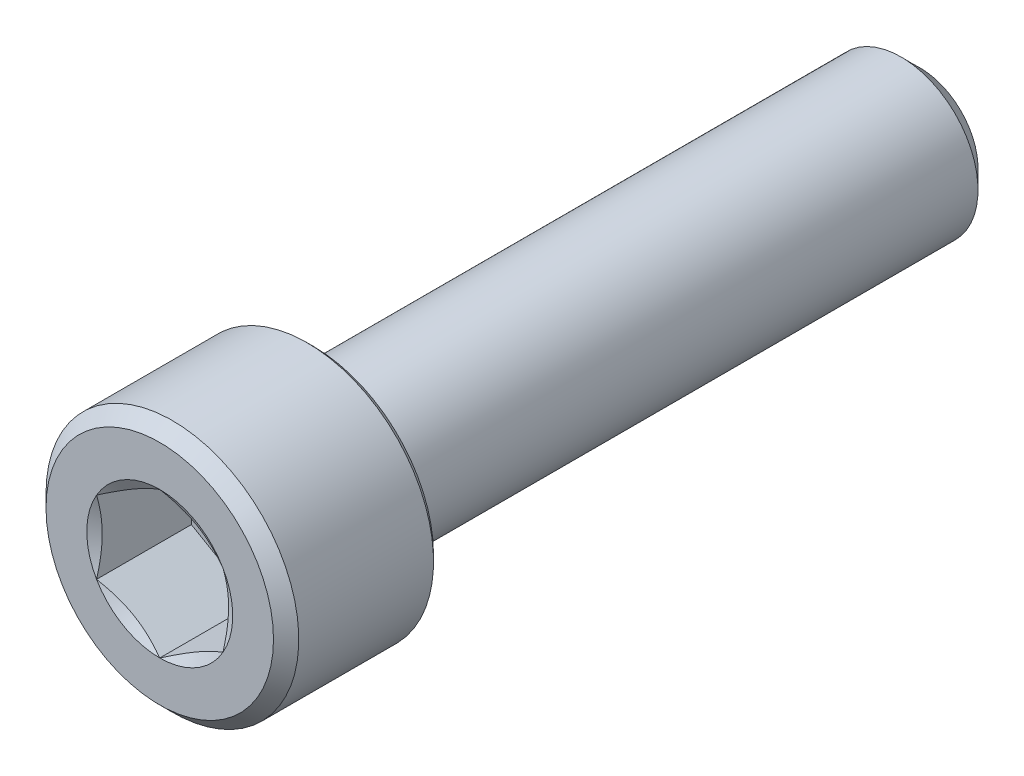
ISO-10303-21;
HEADER;
FILE_DESCRIPTION(('STEP AP214'),'2;1');
FILE_NAME('part.step','',(''),(''),'','','');
FILE_SCHEMA(('AUTOMOTIVE_DESIGN { 1 0 10303 214 1 1 1 1 }'));
ENDSEC;
DATA;
#1=APPLICATION_CONTEXT('core data for automotive mechanical design processes');
#2=APPLICATION_PROTOCOL_DEFINITION('international standard','automotive_design',2000,#1);
#3=PRODUCT_CONTEXT('',#1,'mechanical');
#4=PRODUCT('Part','Part','',(#3));
#5=PRODUCT_RELATED_PRODUCT_CATEGORY('part','',(#4));
#6=PRODUCT_DEFINITION_FORMATION('','',#4);
#7=PRODUCT_DEFINITION_CONTEXT('part definition',#1,'design');
#8=PRODUCT_DEFINITION('design','',#6,#7);
#9=PRODUCT_DEFINITION_SHAPE('','',#8);
#10=(LENGTH_UNIT() NAMED_UNIT(*) SI_UNIT(.MILLI.,.METRE.));
#11=(NAMED_UNIT(*) PLANE_ANGLE_UNIT() SI_UNIT($,.RADIAN.));
#12=(NAMED_UNIT(*) SI_UNIT($,.STERADIAN.) SOLID_ANGLE_UNIT());
#13=UNCERTAINTY_MEASURE_WITH_UNIT(LENGTH_MEASURE(1.E-05),#10,'distance_accuracy_value','');
#14=(GEOMETRIC_REPRESENTATION_CONTEXT(3) GLOBAL_UNCERTAINTY_ASSIGNED_CONTEXT((#13)) GLOBAL_UNIT_ASSIGNED_CONTEXT((#10,
#11,#12)) REPRESENTATION_CONTEXT('',''));
#15=CARTESIAN_POINT('',(0.,0.,0.));
#16=DIRECTION('',(0.,0.,1.));
#17=DIRECTION('',(1.,0.,0.));
#18=AXIS2_PLACEMENT_3D('',#15,#16,#17);
#19=CARTESIAN_POINT('',(0.,3.96875,11.938));
#20=DIRECTION('',(0.,0.,1.));
#21=DIRECTION('',(1.,0.,0.));
#22=AXIS2_PLACEMENT_3D('',#19,#20,#21);
#23=PLANE('',#22);
#24=CARTESIAN_POINT('',(0.,0.,11.938));
#25=DIRECTION('',(0.,0.,1.));
#26=DIRECTION('',(1.,0.,0.));
#27=AXIS2_PLACEMENT_3D('',#24,#25,#26);
#28=CIRCLE('',#27,3.571875);
#29=CARTESIAN_POINT('',(-3.571875,0.,11.938));
#30=VERTEX_POINT('',#29);
#31=EDGE_CURVE('E169',#30,#30,#28,.T.);
#32=ORIENTED_EDGE('',*,*,#31,.T.);
#33=EDGE_LOOP('',(#32));
#34=FACE_BOUND('',#33,.T.);
#35=CARTESIAN_POINT('',(0.,0.,11.938));
#36=DIRECTION('',(0.,0.,1.));
#37=DIRECTION('',(1.,0.,0.));
#38=AXIS2_PLACEMENT_3D('',#35,#36,#37);
#39=CIRCLE('',#38,2.29135888084633);
#40=CARTESIAN_POINT('',(1.984375,1.14567944042316,11.938));
#41=VERTEX_POINT('',#40);
#42=CARTESIAN_POINT('',(0.,2.29135888084632,11.938));
#43=VERTEX_POINT('',#42);
#44=EDGE_CURVE('E87',#41,#43,#39,.T.);
#45=ORIENTED_EDGE('',*,*,#44,.F.);
#46=CARTESIAN_POINT('',(1.984375,-1.14567944042316,11.938));
#47=VERTEX_POINT('',#46);
#48=EDGE_CURVE('E47',#47,#41,#39,.T.);
#49=ORIENTED_EDGE('',*,*,#48,.F.);
#50=CARTESIAN_POINT('',(0.,-2.29135888084633,11.938));
#51=VERTEX_POINT('',#50);
#52=EDGE_CURVE('E274',#51,#47,#39,.T.);
#53=ORIENTED_EDGE('',*,*,#52,.F.);
#54=CARTESIAN_POINT('',(-1.984375,-1.14567944042317,11.938));
#55=VERTEX_POINT('',#54);
#56=EDGE_CURVE('E54',#55,#51,#39,.T.);
#57=ORIENTED_EDGE('',*,*,#56,.F.);
#58=CARTESIAN_POINT('',(-1.984375,1.14567944042316,11.938));
#59=VERTEX_POINT('',#58);
#60=EDGE_CURVE('E127',#59,#55,#39,.T.);
#61=ORIENTED_EDGE('',*,*,#60,.F.);
#62=EDGE_CURVE('E96',#43,#59,#39,.T.);
#63=ORIENTED_EDGE('',*,*,#62,.F.);
#64=EDGE_LOOP('',(#45,#49,#53,#57,#61,#63));
#65=FACE_BOUND('',#64,.T.);
#66=ADVANCED_FACE('F33',(#34,#65),#23,.T.);
#67=CARTESIAN_POINT('',(0.,0.,-11.938));
#68=DIRECTION('',(0.,0.,-1.));
#69=DIRECTION('',(-1.,0.,0.));
#70=AXIS2_PLACEMENT_3D('',#67,#68,#69);
#71=CYLINDRICAL_SURFACE('',#70,3.96875);
#72=CARTESIAN_POINT('',(0.,0.,7.3104375));
#73=DIRECTION('',(0.,0.,-1.));
#74=DIRECTION('',(-1.,0.,0.));
#75=AXIS2_PLACEMENT_3D('',#72,#73,#74);
#76=CIRCLE('',#75,3.96875);
#77=CARTESIAN_POINT('',(-3.96875,0.,7.3104375));
#78=VERTEX_POINT('',#77);
#79=EDGE_CURVE('E11',#78,#78,#76,.F.);
#80=ORIENTED_EDGE('',*,*,#79,.T.);
#81=EDGE_LOOP('',(#80));
#82=FACE_BOUND('',#81,.T.);
#83=CARTESIAN_POINT('',(0.,0.,11.541125));
#84=DIRECTION('',(0.,0.,1.));
#85=DIRECTION('',(1.,0.,0.));
#86=AXIS2_PLACEMENT_3D('',#83,#84,#85);
#87=CIRCLE('',#86,3.96875);
#88=CARTESIAN_POINT('',(-3.96875,0.,11.541125));
#89=VERTEX_POINT('',#88);
#90=EDGE_CURVE('E106',#89,#89,#87,.F.);
#91=ORIENTED_EDGE('',*,*,#90,.T.);
#92=EDGE_LOOP('',(#91));
#93=FACE_BOUND('',#92,.T.);
#94=ADVANCED_FACE('F186',(#82,#93),#71,.T.);
#95=CARTESIAN_POINT('',(0.,3.96875,7.112));
#96=DIRECTION('',(0.,0.,-1.));
#97=DIRECTION('',(-1.,0.,0.));
#98=AXIS2_PLACEMENT_3D('',#95,#96,#97);
#99=PLANE('',#98);
#100=CARTESIAN_POINT('',(0.,0.,7.112));
#101=DIRECTION('',(0.,0.,-1.));
#102=DIRECTION('',(-1.,0.,0.));
#103=AXIS2_PLACEMENT_3D('',#100,#101,#102);
#104=CIRCLE('',#103,3.7703125);
#105=CARTESIAN_POINT('',(-3.7703125,0.,7.112));
#106=VERTEX_POINT('',#105);
#107=EDGE_CURVE('E41',#106,#106,#104,.T.);
#108=ORIENTED_EDGE('',*,*,#107,.T.);
#109=EDGE_LOOP('',(#108));
#110=FACE_BOUND('',#109,.T.);
#111=CARTESIAN_POINT('',(0.,0.,7.112));
#112=DIRECTION('',(0.,0.,-1.));
#113=DIRECTION('',(-1.,0.,0.));
#114=AXIS2_PLACEMENT_3D('',#111,#112,#113);
#115=CIRCLE('',#114,2.413);
#116=CARTESIAN_POINT('',(-2.413,0.,7.112));
#117=VERTEX_POINT('',#116);
#118=EDGE_CURVE('E107',#117,#117,#115,.T.);
#119=ORIENTED_EDGE('',*,*,#118,.F.);
#120=EDGE_LOOP('',(#119));
#121=FACE_BOUND('',#120,.T.);
#122=ADVANCED_FACE('F174',(#110,#121),#99,.T.);
#123=CARTESIAN_POINT('',(0.,0.,-11.938));
#124=DIRECTION('',(0.,0.,-1.));
#125=DIRECTION('',(-1.,0.,0.));
#126=AXIS2_PLACEMENT_3D('',#123,#124,#125);
#127=CYLINDRICAL_SURFACE('',#126,2.413);
#128=ORIENTED_EDGE('',*,*,#118,.T.);
#129=EDGE_LOOP('',(#128));
#130=FACE_BOUND('',#129,.T.);
#131=CARTESIAN_POINT('',(0.,0.,-11.3426875));
#132=DIRECTION('',(0.,0.,-1.));
#133=DIRECTION('',(-1.,0.,0.));
#134=AXIS2_PLACEMENT_3D('',#131,#132,#133);
#135=CIRCLE('',#134,2.413);
#136=CARTESIAN_POINT('',(-2.413,0.,-11.3426875));
#137=VERTEX_POINT('',#136);
#138=EDGE_CURVE('E215',#137,#137,#135,.T.);
#139=ORIENTED_EDGE('',*,*,#138,.F.);
#140=EDGE_LOOP('',(#139));
#141=FACE_BOUND('',#140,.T.);
#142=ADVANCED_FACE('F197',(#130,#141),#127,.T.);
#143=CARTESIAN_POINT('',(0.,0.,-11.938));
#144=DIRECTION('',(0.,0.,1.));
#145=DIRECTION('',(1.,0.,0.));
#146=AXIS2_PLACEMENT_3D('',#143,#144,#145);
#147=CONICAL_SURFACE('',#146,1.8176875,0.785398163397443);
#148=ORIENTED_EDGE('',*,*,#138,.T.);
#149=EDGE_LOOP('',(#148));
#150=FACE_BOUND('',#149,.T.);
#151=CARTESIAN_POINT('',(0.,0.,-11.938));
#152=DIRECTION('',(0.,0.,-1.));
#153=DIRECTION('',(-1.,0.,0.));
#154=AXIS2_PLACEMENT_3D('',#151,#152,#153);
#155=CIRCLE('',#154,1.8176875);
#156=CARTESIAN_POINT('',(-1.8176875,0.,-11.938));
#157=VERTEX_POINT('',#156);
#158=EDGE_CURVE('E213',#157,#157,#155,.T.);
#159=ORIENTED_EDGE('',*,*,#158,.F.);
#160=EDGE_LOOP('',(#159));
#161=FACE_BOUND('',#160,.T.);
#162=ADVANCED_FACE('F200',(#150,#161),#147,.T.);
#163=CARTESIAN_POINT('',(0.,1.8176875,-11.938));
#164=DIRECTION('',(0.,0.,-1.));
#165=DIRECTION('',(-1.,0.,0.));
#166=AXIS2_PLACEMENT_3D('',#163,#164,#165);
#167=PLANE('',#166);
#168=ORIENTED_EDGE('',*,*,#158,.T.);
#169=EDGE_LOOP('',(#168));
#170=FACE_BOUND('',#169,.T.);
#171=ADVANCED_FACE('F203',(#170),#167,.T.);
#172=CARTESIAN_POINT('',(0.,0.,11.938));
#173=DIRECTION('',(0.,0.,1.));
#174=DIRECTION('',(1.,0.,0.));
#175=AXIS2_PLACEMENT_3D('',#172,#173,#174);
#176=CONICAL_SURFACE('',#175,2.29135888084633,1.0471975511966);
#177=ORIENTED_EDGE('',*,*,#62,.T.);
#178=CARTESIAN_POINT('',(0.000199999999999337,2.29147435090016,11.9380666717058));
#179=CARTESIAN_POINT('',(-0.0870046387806771,2.24112672922556,11.9089856822402));
#180=CARTESIAN_POINT('',(-0.174962019304997,2.19034451190263,11.8825372080271));
#181=CARTESIAN_POINT('',(-0.352399978672321,2.08790065829744,11.8363702712065));
#182=CARTESIAN_POINT('',(-0.44188371125632,2.03623720120198,11.816668142249));
#183=CARTESIAN_POINT('',(-0.61974214801247,1.93355058486317,11.7859977319315));
#184=CARTESIAN_POINT('',(-0.708089480306095,1.88254322878126,11.7748253427202));
#185=CARTESIAN_POINT('',(-0.885200028110951,1.78028840632981,11.7614857960544));
#186=CARTESIAN_POINT('',(-0.973962599510548,1.72904131183828,11.7593075944601));
#187=CARTESIAN_POINT('',(-1.13983230286466,1.63327639395638,11.7638295515083));
#188=CARTESIAN_POINT('',(-1.21696421566591,1.58874426333747,11.7694194134559));
#189=CARTESIAN_POINT('',(-1.37072550718908,1.49997014028562,11.787138933897));
#190=CARTESIAN_POINT('',(-1.44735435374553,1.45572845509857,11.7992746503295));
#191=CARTESIAN_POINT('',(-1.60143288850678,1.36677117157781,11.8296141588444));
#192=CARTESIAN_POINT('',(-1.67886306721268,1.32206683705856,11.847946609291));
#193=CARTESIAN_POINT('',(-1.83256831124359,1.23332507304146,11.8895545064002));
#194=CARTESIAN_POINT('',(-1.90884534705293,1.18928650588395,11.9128201712824));
#195=CARTESIAN_POINT('',(-1.984575,1.14556397036932,11.9380666717058));
#196=B_SPLINE_CURVE_WITH_KNOTS('',3,(#178,#179,#180,#181,#182,#183,#184,#185,#186,#187,#188,
#189,#190,#191,#192,#193,#194,#195),.UNSPECIFIED.,.F.,.F.,(4,2,2,2,2,2,2,2,4),(0.,
0.314555137114086,0.629866549668807,0.937373439505935,1.24450262309398,1.51196650590478,
1.77967834211415,2.05332989762155,2.32644383656793),.UNSPECIFIED.);
#197=EDGE_CURVE('E101',#43,#59,#196,.T.);
#198=ORIENTED_EDGE('',*,*,#197,.F.);
#199=EDGE_LOOP('',(#177,#198));
#200=FACE_BOUND('',#199,.T.);
#201=ADVANCED_FACE('F102',(#200),#176,.F.);
#202=ORIENTED_EDGE('',*,*,#60,.T.);
#203=CARTESIAN_POINT('',(-1.984375,-2.96692860034506,12.6758606510924));
#204=CARTESIAN_POINT('',(-1.984375,-2.88123645369666,12.6347488017753));
#205=CARTESIAN_POINT('',(-1.984375,-2.79533554929687,12.5940639729561));
#206=CARTESIAN_POINT('',(-1.984375,-2.62300496253372,12.5137905979452));
#207=CARTESIAN_POINT('',(-1.984375,-2.53657518838115,12.4742022490471));
#208=CARTESIAN_POINT('',(-1.984375,-2.36258003650985,12.3961429144296));
#209=CARTESIAN_POINT('',(-1.984375,-2.27501095051754,12.3576801633989));
#210=CARTESIAN_POINT('',(-1.984375,-2.09913795632987,12.2824794270975));
#211=CARTESIAN_POINT('',(-1.984375,-2.01083408662377,12.2457413521464));
#212=CARTESIAN_POINT('',(-1.984375,-1.83102497893539,12.173513729355));
#213=CARTESIAN_POINT('',(-1.984375,-1.73949640320228,12.1380819390739));
#214=CARTESIAN_POINT('',(-1.984375,-1.55533214713673,12.0701641835568));
#215=CARTESIAN_POINT('',(-1.984375,-1.46269633980312,12.0376785599926));
#216=CARTESIAN_POINT('',(-1.984375,-1.27638419434466,11.9765821363592));
#217=CARTESIAN_POINT('',(-1.984375,-1.18271082678456,11.9479623752382));
#218=CARTESIAN_POINT('',(-1.984375,-0.994021652382587,11.8955763688606));
#219=CARTESIAN_POINT('',(-1.984375,-0.899006185229732,11.8718089181985));
#220=CARTESIAN_POINT('',(-1.984375,-0.707830512458421,11.8303947393806));
#221=CARTESIAN_POINT('',(-1.984375,-0.61167308437324,11.812735440066));
#222=CARTESIAN_POINT('',(-1.984375,-0.418283092113672,11.7846930965335));
#223=CARTESIAN_POINT('',(-1.984375,-0.321050601045251,11.7743095606059));
#224=CARTESIAN_POINT('',(-1.984375,-0.127210752774484,11.7617852009906));
#225=CARTESIAN_POINT('',(-1.984375,-0.0306098639781242,11.7595471073686));
#226=CARTESIAN_POINT('',(-1.984375,0.162431915887105,11.7632420470322));
#227=CARTESIAN_POINT('',(-1.984375,0.258872796678697,11.7691755862751));
#228=CARTESIAN_POINT('',(-1.984375,0.496826477184733,11.7933755736915));
#229=CARTESIAN_POINT('',(-1.984375,0.637878211825127,11.8161772202142));
#230=CARTESIAN_POINT('',(-1.984375,0.917238703702528,11.8749760242614));
#231=CARTESIAN_POINT('',(-1.984375,1.05554394232965,11.9109890855425));
#232=CARTESIAN_POINT('',(-1.984375,1.26239464896717,11.9725082078903));
#233=CARTESIAN_POINT('',(-1.984375,1.33200934564274,11.9945514264146));
#234=CARTESIAN_POINT('',(-1.984375,1.47051409380588,12.0406769862575));
#235=CARTESIAN_POINT('',(-1.984375,1.53940456776433,12.0647580550061));
#236=CARTESIAN_POINT('',(-1.984375,1.67655293465251,12.1146095886895));
#237=CARTESIAN_POINT('',(-1.984375,1.74481093998431,12.1403797466023));
#238=CARTESIAN_POINT('',(-1.984375,1.88078910071683,12.1933307126816));
#239=CARTESIAN_POINT('',(-1.984375,1.94850916300286,12.220511759183));
#240=CARTESIAN_POINT('',(-1.984375,2.12136731788458,12.2916336238359));
#241=CARTESIAN_POINT('',(-1.984375,2.22615977384556,12.3364135967013));
#242=CARTESIAN_POINT('',(-1.984375,2.43479837304526,12.4281321956825));
#243=CARTESIAN_POINT('',(-1.984375,2.5386444446916,12.4750709835113));
#244=CARTESIAN_POINT('',(-1.984375,2.84907841644385,12.6183645613235));
#245=CARTESIAN_POINT('',(-1.984375,3.05452739791262,12.7171818752644));
#246=CARTESIAN_POINT('',(-1.984375,3.46367014223902,12.9189608857248));
#247=CARTESIAN_POINT('',(-1.984375,3.66736143684958,13.021927527753));
#248=CARTESIAN_POINT('',(-1.984375,4.0733484486621,13.2305084165548));
#249=CARTESIAN_POINT('',(-1.984375,4.27564433912762,13.3361223267935));
#250=CARTESIAN_POINT('',(-1.984375,4.66022184962415,13.5391193368616));
#251=CARTESIAN_POINT('',(-1.984375,4.84259034249047,13.6363384272925));
#252=CARTESIAN_POINT('',(-1.984375,5.20674070245669,13.8318843204883));
#253=CARTESIAN_POINT('',(-1.984375,5.38852254752481,13.9302111642466));
#254=CARTESIAN_POINT('',(-1.984375,5.7511724793118,14.127443617507));
#255=CARTESIAN_POINT('',(-1.984375,5.93204171415673,14.2263471187779));
#256=CARTESIAN_POINT('',(-1.984375,6.29341450955435,14.4247978398903));
#257=CARTESIAN_POINT('',(-1.984375,6.47391808874828,14.5243450257738));
#258=CARTESIAN_POINT('',(-1.984375,6.6542902961452,14.6241282522634));
#259=B_SPLINE_CURVE_WITH_KNOTS('',3,(#203,#204,#205,#206,#207,#208,#209,#210,#211,#212,#213,
#214,#215,#216,#217,#218,#219,#220,#221,#222,#223,#224,#225,#226,#227,#228,#229,#230,#231,#232,
#233,#234,#235,#236,#237,#238,#239,#240,#241,#242,#243,#244,#245,#246,#247,#248,#249,#250,#251,
#252,#253,#254,#255,#256,#257,#258),.UNSPECIFIED.,.F.,.F.,(4,2,2,2,2,2,2,2,2,2,2,2,2,2,2,2,2,2,
2,2,2,2,2,2,2,2,2,4),(0.,0.285135519832372,0.570322016122786,0.85723846381979,1.14413997577448,
1.43854271801315,1.7329795590899,2.02672173491208,2.32039085060263,2.61345191984503,
2.90649318156652,3.19602335108127,3.48557144803805,3.91334047285798,4.34162614021154,
4.56066589824458,4.7795698685272,4.99843415889189,5.21733554208811,5.55917796423186,
5.9010460350302,6.58489509249956,7.26958483186156,7.95418796687477,8.57417425374277,
9.19418355960939,9.81261585701216,10.431015790458),.UNSPECIFIED.);
#260=EDGE_CURVE('E95',#59,#55,#259,.F.);
#261=ORIENTED_EDGE('',*,*,#260,.F.);
#262=EDGE_LOOP('',(#202,#261));
#263=FACE_BOUND('',#262,.T.);
#264=ADVANCED_FACE('F210',(#263),#176,.F.);
#265=ORIENTED_EDGE('',*,*,#56,.T.);
#266=CARTESIAN_POINT('',(-1.984575,-1.14556397036933,11.9380666717058));
#267=CARTESIAN_POINT('',(-1.89737036121932,-1.19591159204393,11.9089856822402));
#268=CARTESIAN_POINT('',(-1.809412980695,-1.24669380936686,11.8825372080271));
#269=CARTESIAN_POINT('',(-1.63197502132768,-1.34913766297205,11.8363702712065));
#270=CARTESIAN_POINT('',(-1.54249128874368,-1.40080112006751,11.816668142249));
#271=CARTESIAN_POINT('',(-1.36463285198753,-1.50348773640632,11.7859977319315));
#272=CARTESIAN_POINT('',(-1.27628551969391,-1.55449509248823,11.7748253427202));
#273=CARTESIAN_POINT('',(-1.09917497188905,-1.65674991493968,11.7614857960544));
#274=CARTESIAN_POINT('',(-1.01041240048945,-1.7079970094312,11.7593075944601));
#275=CARTESIAN_POINT('',(-0.844542697135339,-1.80376192731311,11.7638295515083));
#276=CARTESIAN_POINT('',(-0.767410784334094,-1.84829405793202,11.7694194134559));
#277=CARTESIAN_POINT('',(-0.61364949281092,-1.93706818098387,11.787138933897));
#278=CARTESIAN_POINT('',(-0.537020646254476,-1.98130986617092,11.7992746503295));
#279=CARTESIAN_POINT('',(-0.382942111493217,-2.07026714969167,11.8296141588444));
#280=CARTESIAN_POINT('',(-0.305511932787317,-2.11497148421093,11.847946609291));
#281=CARTESIAN_POINT('',(-0.151806688756411,-2.20371324822803,11.8895545064002));
#282=CARTESIAN_POINT('',(-0.0755296529470673,-2.24775181538554,11.9128201712824));
#283=CARTESIAN_POINT('',(0.000200000000000565,-2.29147435090016,11.9380666717058));
#284=B_SPLINE_CURVE_WITH_KNOTS('',3,(#266,#267,#268,#269,#270,#271,#272,#273,#274,#275,#276,
#277,#278,#279,#280,#281,#282,#283),.UNSPECIFIED.,.F.,.F.,(4,2,2,2,2,2,2,2,4),(0.,
0.314555137114085,0.629866549668806,0.937373439505932,1.24450262309398,1.51196650590478,
1.77967834211415,2.05332989762155,2.32644383656793),.UNSPECIFIED.);
#285=EDGE_CURVE('E137',#55,#51,#284,.T.);
#286=ORIENTED_EDGE('',*,*,#285,.F.);
#287=EDGE_LOOP('',(#265,#286));
#288=FACE_BOUND('',#287,.T.);
#289=ADVANCED_FACE('F277',(#288),#176,.F.);
#290=ORIENTED_EDGE('',*,*,#52,.T.);
#291=CARTESIAN_POINT('',(-0.000199999999999211,-2.29147435090017,11.9380666717058));
#292=CARTESIAN_POINT('',(0.087004638780677,-2.24112672922556,11.9089856822402));
#293=CARTESIAN_POINT('',(0.174962019304997,-2.19034451190263,11.8825372080271));
#294=CARTESIAN_POINT('',(0.35239997867232,-2.08790065829744,11.8363702712065));
#295=CARTESIAN_POINT('',(0.441883711256319,-2.03623720120198,11.816668142249));
#296=CARTESIAN_POINT('',(0.619742148012468,-1.93355058486317,11.7859977319315));
#297=CARTESIAN_POINT('',(0.708089480306093,-1.88254322878126,11.7748253427202));
#298=CARTESIAN_POINT('',(0.885200028110949,-1.78028840632981,11.7614857960544));
#299=CARTESIAN_POINT('',(0.973962599510545,-1.72904131183829,11.7593075944601));
#300=CARTESIAN_POINT('',(1.13983230286466,-1.63327639395638,11.7638295515083));
#301=CARTESIAN_POINT('',(1.21696421566591,-1.58874426333747,11.7694194134559));
#302=CARTESIAN_POINT('',(1.37072550718908,-1.49997014028563,11.787138933897));
#303=CARTESIAN_POINT('',(1.44735435374552,-1.45572845509857,11.7992746503295));
#304=CARTESIAN_POINT('',(1.60143288850678,-1.36677117157782,11.8296141588444));
#305=CARTESIAN_POINT('',(1.67886306721268,-1.32206683705856,11.847946609291));
#306=CARTESIAN_POINT('',(1.83256831124359,-1.23332507304146,11.8895545064002));
#307=CARTESIAN_POINT('',(1.90884534705293,-1.18928650588395,11.9128201712824));
#308=CARTESIAN_POINT('',(1.984575,-1.14556397036933,11.9380666717058));
#309=B_SPLINE_CURVE_WITH_KNOTS('',3,(#291,#292,#293,#294,#295,#296,#297,#298,#299,#300,#301,
#302,#303,#304,#305,#306,#307,#308),.UNSPECIFIED.,.F.,.F.,(4,2,2,2,2,2,2,2,4),(0.,
0.314555137114085,0.629866549668805,0.937373439505931,1.24450262309398,1.51196650590478,
1.77967834211415,2.05332989762155,2.32644383656793),.UNSPECIFIED.);
#310=EDGE_CURVE('E251',#51,#47,#309,.T.);
#311=ORIENTED_EDGE('',*,*,#310,.F.);
#312=EDGE_LOOP('',(#290,#311));
#313=FACE_BOUND('',#312,.T.);
#314=ADVANCED_FACE('F276',(#313),#176,.F.);
#315=ORIENTED_EDGE('',*,*,#48,.T.);
#316=CARTESIAN_POINT('',(1.984375,-2.96692860034506,12.6758606510924));
#317=CARTESIAN_POINT('',(1.984375,-2.88123645369666,12.6347488017753));
#318=CARTESIAN_POINT('',(1.984375,-2.79533554929687,12.5940639729561));
#319=CARTESIAN_POINT('',(1.984375,-2.62300496253372,12.5137905979452));
#320=CARTESIAN_POINT('',(1.984375,-2.53657518838114,12.4742022490471));
#321=CARTESIAN_POINT('',(1.984375,-2.36258003650985,12.3961429144296));
#322=CARTESIAN_POINT('',(1.984375,-2.27501095051754,12.3576801633989));
#323=CARTESIAN_POINT('',(1.984375,-2.09913795632987,12.2824794270975));
#324=CARTESIAN_POINT('',(1.984375,-2.01083408662377,12.2457413521464));
#325=CARTESIAN_POINT('',(1.984375,-1.83102497893539,12.173513729355));
#326=CARTESIAN_POINT('',(1.984375,-1.73949640320228,12.1380819390739));
#327=CARTESIAN_POINT('',(1.984375,-1.55533214713673,12.0701641835568));
#328=CARTESIAN_POINT('',(1.984375,-1.46269633980312,12.0376785599926));
#329=CARTESIAN_POINT('',(1.984375,-1.27638419434466,11.9765821363592));
#330=CARTESIAN_POINT('',(1.984375,-1.18271082678456,11.9479623752382));
#331=CARTESIAN_POINT('',(1.984375,-0.994021652382587,11.8955763688606));
#332=CARTESIAN_POINT('',(1.984375,-0.899006185229732,11.8718089181985));
#333=CARTESIAN_POINT('',(1.984375,-0.70783051245842,11.8303947393806));
#334=CARTESIAN_POINT('',(1.984375,-0.611673084373239,11.812735440066));
#335=CARTESIAN_POINT('',(1.984375,-0.418283092113671,11.7846930965335));
#336=CARTESIAN_POINT('',(1.984375,-0.32105060104525,11.7743095606059));
#337=CARTESIAN_POINT('',(1.984375,-0.127210752774483,11.7617852009906));
#338=CARTESIAN_POINT('',(1.984375,-0.0306098639781236,11.7595471073686));
#339=CARTESIAN_POINT('',(1.984375,0.162431915887106,11.7632420470322));
#340=CARTESIAN_POINT('',(1.984375,0.258872796678698,11.7691755862751));
#341=CARTESIAN_POINT('',(1.984375,0.496826477184734,11.7933755736915));
#342=CARTESIAN_POINT('',(1.984375,0.637878211825127,11.8161772202142));
#343=CARTESIAN_POINT('',(1.984375,0.917238703702528,11.8749760242614));
#344=CARTESIAN_POINT('',(1.984375,1.05554394232965,11.9109890855425));
#345=CARTESIAN_POINT('',(1.984375,1.26239464896717,11.9725082078903));
#346=CARTESIAN_POINT('',(1.984375,1.33200934564274,11.9945514264146));
#347=CARTESIAN_POINT('',(1.984375,1.47051409380588,12.0406769862575));
#348=CARTESIAN_POINT('',(1.984375,1.53940456776433,12.0647580550061));
#349=CARTESIAN_POINT('',(1.984375,1.67655293465251,12.1146095886895));
#350=CARTESIAN_POINT('',(1.984375,1.74481093998432,12.1403797466023));
#351=CARTESIAN_POINT('',(1.984375,1.88078910071683,12.1933307126816));
#352=CARTESIAN_POINT('',(1.984375,1.94850916300287,12.220511759183));
#353=CARTESIAN_POINT('',(1.984375,2.12136731788459,12.2916336238359));
#354=CARTESIAN_POINT('',(1.984375,2.22615977384557,12.3364135967013));
#355=CARTESIAN_POINT('',(1.984375,2.43479837304527,12.4281321956825));
#356=CARTESIAN_POINT('',(1.984375,2.5386444446916,12.4750709835113));
#357=CARTESIAN_POINT('',(1.984375,2.84907841644385,12.6183645613235));
#358=CARTESIAN_POINT('',(1.984375,3.05452739791262,12.7171818752644));
#359=CARTESIAN_POINT('',(1.984375,3.46367014223902,12.9189608857248));
#360=CARTESIAN_POINT('',(1.984375,3.66736143684958,13.021927527753));
#361=CARTESIAN_POINT('',(1.984375,4.07334844866211,13.2305084165548));
#362=CARTESIAN_POINT('',(1.984375,4.27564433912762,13.3361223267935));
#363=CARTESIAN_POINT('',(1.984375,4.66022184962415,13.5391193368616));
#364=CARTESIAN_POINT('',(1.984375,4.84259034249047,13.6363384272925));
#365=CARTESIAN_POINT('',(1.984375,5.20674070245669,13.8318843204883));
#366=CARTESIAN_POINT('',(1.984375,5.38852254752481,13.9302111642466));
#367=CARTESIAN_POINT('',(1.984375,5.75117247931181,14.127443617507));
#368=CARTESIAN_POINT('',(1.984375,5.93204171415673,14.2263471187779));
#369=CARTESIAN_POINT('',(1.984375,6.29341450955435,14.4247978398903));
#370=CARTESIAN_POINT('',(1.984375,6.47391808874828,14.5243450257738));
#371=CARTESIAN_POINT('',(1.984375,6.6542902961452,14.6241282522634));
#372=B_SPLINE_CURVE_WITH_KNOTS('',3,(#316,#317,#318,#319,#320,#321,#322,#323,#324,#325,#326,
#327,#328,#329,#330,#331,#332,#333,#334,#335,#336,#337,#338,#339,#340,#341,#342,#343,#344,#345,
#346,#347,#348,#349,#350,#351,#352,#353,#354,#355,#356,#357,#358,#359,#360,#361,#362,#363,#364,
#365,#366,#367,#368,#369,#370,#371),.UNSPECIFIED.,.F.,.F.,(4,2,2,2,2,2,2,2,2,2,2,2,2,2,2,2,2,2,
2,2,2,2,2,2,2,2,2,4),(0.,0.285135519832372,0.570322016122785,0.85723846381979,1.14413997577448,
1.43854271801315,1.7329795590899,2.02672173491208,2.32039085060262,2.61345191984503,
2.90649318156652,3.19602335108127,3.48557144803805,3.91334047285798,4.34162614021154,
4.56066589824458,4.7795698685272,4.99843415889189,5.21733554208811,5.55917796423187,
5.90104603503021,6.58489509249957,7.26958483186156,7.95418796687477,8.57417425374277,
9.1941835596094,9.81261585701217,10.431015790458),.UNSPECIFIED.);
#373=EDGE_CURVE('E117',#47,#41,#372,.T.);
#374=ORIENTED_EDGE('',*,*,#373,.F.);
#375=EDGE_LOOP('',(#315,#374));
#376=FACE_BOUND('',#375,.T.);
#377=ADVANCED_FACE('F287',(#376),#176,.F.);
#378=ORIENTED_EDGE('',*,*,#44,.T.);
#379=CARTESIAN_POINT('',(1.984575,1.14556397036933,11.9380666717058));
#380=CARTESIAN_POINT('',(1.89737036121932,1.19591159204393,11.9089856822402));
#381=CARTESIAN_POINT('',(1.809412980695,1.24669380936686,11.8825372080271));
#382=CARTESIAN_POINT('',(1.63197502132768,1.34913766297205,11.8363702712065));
#383=CARTESIAN_POINT('',(1.54249128874368,1.40080112006751,11.816668142249));
#384=CARTESIAN_POINT('',(1.36463285198753,1.50348773640632,11.7859977319315));
#385=CARTESIAN_POINT('',(1.27628551969391,1.55449509248823,11.7748253427202));
#386=CARTESIAN_POINT('',(1.09917497188905,1.65674991493968,11.7614857960544));
#387=CARTESIAN_POINT('',(1.01041240048945,1.70799700943121,11.7593075944601));
#388=CARTESIAN_POINT('',(0.844542697135339,1.80376192731311,11.7638295515083));
#389=CARTESIAN_POINT('',(0.767410784334093,1.84829405793202,11.7694194134559));
#390=CARTESIAN_POINT('',(0.613649492810919,1.93706818098387,11.787138933897));
#391=CARTESIAN_POINT('',(0.537020646254476,1.98130986617092,11.7992746503295));
#392=CARTESIAN_POINT('',(0.382942111493217,2.07026714969167,11.8296141588444));
#393=CARTESIAN_POINT('',(0.305511932787317,2.11497148421093,11.847946609291));
#394=CARTESIAN_POINT('',(0.151806688756411,2.20371324822803,11.8895545064002));
#395=CARTESIAN_POINT('',(0.0755296529470672,2.24775181538554,11.9128201712824));
#396=CARTESIAN_POINT('',(-0.000200000000000733,2.29147435090016,11.9380666717058));
#397=B_SPLINE_CURVE_WITH_KNOTS('',3,(#379,#380,#381,#382,#383,#384,#385,#386,#387,#388,#389,
#390,#391,#392,#393,#394,#395,#396),.UNSPECIFIED.,.F.,.F.,(4,2,2,2,2,2,2,2,4),(0.,
0.314555137114086,0.629866549668806,0.937373439505933,1.24450262309398,1.51196650590478,
1.77967834211415,2.05332989762155,2.32644383656793),.UNSPECIFIED.);
#398=EDGE_CURVE('E91',#41,#43,#397,.T.);
#399=ORIENTED_EDGE('',*,*,#398,.F.);
#400=EDGE_LOOP('',(#378,#399));
#401=FACE_BOUND('',#400,.T.);
#402=ADVANCED_FACE('F89',(#401),#176,.F.);
#403=CARTESIAN_POINT('',(0.,0.,8.9614375));
#404=DIRECTION('',(0.,0.,1.));
#405=DIRECTION('',(1.,0.,0.));
#406=AXIS2_PLACEMENT_3D('',#403,#404,#405);
#407=PLANE('',#406);
#408=DIRECTION('',(-0.866025403784439,0.5,0.));
#409=VECTOR('',#408,1.);
#410=CARTESIAN_POINT('',(1.984375,1.14567944042316,8.9614375));
#411=LINE('',#410,#409);
#412=CARTESIAN_POINT('',(1.984375,1.14567944042316,8.9614375));
#413=VERTEX_POINT('',#412);
#414=CARTESIAN_POINT('',(0.,2.29135888084633,8.9614375));
#415=VERTEX_POINT('',#414);
#416=EDGE_CURVE('E116',#413,#415,#411,.T.);
#417=ORIENTED_EDGE('',*,*,#416,.T.);
#418=DIRECTION('',(-0.866025403784438,-0.5,0.));
#419=VECTOR('',#418,1.);
#420=CARTESIAN_POINT('',(0.,2.29135888084633,8.9614375));
#421=LINE('',#420,#419);
#422=CARTESIAN_POINT('',(-1.984375,1.14567944042316,8.9614375));
#423=VERTEX_POINT('',#422);
#424=EDGE_CURVE('E121',#415,#423,#421,.T.);
#425=ORIENTED_EDGE('',*,*,#424,.T.);
#426=DIRECTION('',(0.,-1.,0.));
#427=VECTOR('',#426,1.);
#428=CARTESIAN_POINT('',(-1.984375,1.14567944042316,8.9614375));
#429=LINE('',#428,#427);
#430=CARTESIAN_POINT('',(-1.984375,-1.14567944042316,8.9614375));
#431=VERTEX_POINT('',#430);
#432=EDGE_CURVE('E237',#423,#431,#429,.T.);
#433=ORIENTED_EDGE('',*,*,#432,.T.);
#434=DIRECTION('',(0.866025403784439,-0.5,0.));
#435=VECTOR('',#434,1.);
#436=CARTESIAN_POINT('',(-1.984375,-1.14567944042316,8.9614375));
#437=LINE('',#436,#435);
#438=CARTESIAN_POINT('',(0.,-2.29135888084633,8.9614375));
#439=VERTEX_POINT('',#438);
#440=EDGE_CURVE('E234',#431,#439,#437,.T.);
#441=ORIENTED_EDGE('',*,*,#440,.T.);
#442=DIRECTION('',(0.866025403784438,0.5,0.));
#443=VECTOR('',#442,1.);
#444=CARTESIAN_POINT('',(0.,-2.29135888084633,8.9614375));
#445=LINE('',#444,#443);
#446=CARTESIAN_POINT('',(1.984375,-1.14567944042316,8.9614375));
#447=VERTEX_POINT('',#446);
#448=EDGE_CURVE('E231',#439,#447,#445,.T.);
#449=ORIENTED_EDGE('',*,*,#448,.T.);
#450=DIRECTION('',(0.,1.,0.));
#451=VECTOR('',#450,1.);
#452=CARTESIAN_POINT('',(1.984375,-1.14567944042316,8.9614375));
#453=LINE('',#452,#451);
#454=EDGE_CURVE('E124',#447,#413,#453,.T.);
#455=ORIENTED_EDGE('',*,*,#454,.T.);
#456=EDGE_LOOP('',(#417,#425,#433,#441,#449,#455));
#457=FACE_BOUND('',#456,.T.);
#458=ADVANCED_FACE('F157',(#457),#407,.T.);
#459=CARTESIAN_POINT('',(0.,2.29135888084633,8.9614375));
#460=DIRECTION('',(-0.5,0.866025403784438,0.));
#461=DIRECTION('',(-0.866025403784439,-0.5,0.));
#462=AXIS2_PLACEMENT_3D('',#459,#460,#461);
#463=PLANE('',#462);
#464=DIRECTION('',(0.,0.,1.));
#465=VECTOR('',#464,1.);
#466=CARTESIAN_POINT('',(0.,2.29135888084633,8.9614375));
#467=LINE('',#466,#465);
#468=EDGE_CURVE('E113',#415,#43,#467,.T.);
#469=ORIENTED_EDGE('',*,*,#468,.T.);
#470=ORIENTED_EDGE('',*,*,#197,.T.);
#471=DIRECTION('',(0.,0.,1.));
#472=VECTOR('',#471,1.);
#473=CARTESIAN_POINT('',(-1.984375,1.14567944042316,8.9614375));
#474=LINE('',#473,#472);
#475=EDGE_CURVE('E123',#423,#59,#474,.T.);
#476=ORIENTED_EDGE('',*,*,#475,.F.);
#477=ORIENTED_EDGE('',*,*,#424,.F.);
#478=EDGE_LOOP('',(#469,#470,#476,#477));
#479=FACE_BOUND('',#478,.T.);
#480=ADVANCED_FACE('F119',(#479),#463,.F.);
#481=CARTESIAN_POINT('',(-1.984375,1.14567944042316,8.9614375));
#482=DIRECTION('',(-1.,0.,0.));
#483=DIRECTION('',(0.,-1.,0.));
#484=AXIS2_PLACEMENT_3D('',#481,#482,#483);
#485=PLANE('',#484);
#486=ORIENTED_EDGE('',*,*,#475,.T.);
#487=ORIENTED_EDGE('',*,*,#260,.T.);
#488=DIRECTION('',(0.,0.,1.));
#489=VECTOR('',#488,1.);
#490=CARTESIAN_POINT('',(-1.984375,-1.14567944042316,8.9614375));
#491=LINE('',#490,#489);
#492=EDGE_CURVE('E222',#431,#55,#491,.T.);
#493=ORIENTED_EDGE('',*,*,#492,.F.);
#494=ORIENTED_EDGE('',*,*,#432,.F.);
#495=EDGE_LOOP('',(#486,#487,#493,#494));
#496=FACE_BOUND('',#495,.T.);
#497=ADVANCED_FACE('F146',(#496),#485,.F.);
#498=CARTESIAN_POINT('',(-1.984375,-1.14567944042316,8.9614375));
#499=DIRECTION('',(-0.5,-0.866025403784439,0.));
#500=DIRECTION('',(0.866025403784439,-0.5,0.));
#501=AXIS2_PLACEMENT_3D('',#498,#499,#500);
#502=PLANE('',#501);
#503=ORIENTED_EDGE('',*,*,#492,.T.);
#504=ORIENTED_EDGE('',*,*,#285,.T.);
#505=DIRECTION('',(0.,0.,1.));
#506=VECTOR('',#505,1.);
#507=CARTESIAN_POINT('',(0.,-2.29135888084633,8.9614375));
#508=LINE('',#507,#506);
#509=EDGE_CURVE('E225',#439,#51,#508,.T.);
#510=ORIENTED_EDGE('',*,*,#509,.F.);
#511=ORIENTED_EDGE('',*,*,#440,.F.);
#512=EDGE_LOOP('',(#503,#504,#510,#511));
#513=FACE_BOUND('',#512,.T.);
#514=ADVANCED_FACE('F150',(#513),#502,.F.);
#515=CARTESIAN_POINT('',(0.,-2.29135888084633,8.9614375));
#516=DIRECTION('',(0.5,-0.866025403784438,0.));
#517=DIRECTION('',(0.866025403784439,0.5,0.));
#518=AXIS2_PLACEMENT_3D('',#515,#516,#517);
#519=PLANE('',#518);
#520=ORIENTED_EDGE('',*,*,#509,.T.);
#521=ORIENTED_EDGE('',*,*,#310,.T.);
#522=DIRECTION('',(0.,0.,1.));
#523=VECTOR('',#522,1.);
#524=CARTESIAN_POINT('',(1.984375,-1.14567944042316,8.9614375));
#525=LINE('',#524,#523);
#526=EDGE_CURVE('E218',#447,#47,#525,.T.);
#527=ORIENTED_EDGE('',*,*,#526,.F.);
#528=ORIENTED_EDGE('',*,*,#448,.F.);
#529=EDGE_LOOP('',(#520,#521,#527,#528));
#530=FACE_BOUND('',#529,.T.);
#531=ADVANCED_FACE('F259',(#530),#519,.F.);
#532=CARTESIAN_POINT('',(1.984375,-1.14567944042316,8.9614375));
#533=DIRECTION('',(1.,0.,0.));
#534=DIRECTION('',(0.,0.,-1.));
#535=AXIS2_PLACEMENT_3D('',#532,#533,#534);
#536=PLANE('',#535);
#537=ORIENTED_EDGE('',*,*,#526,.T.);
#538=ORIENTED_EDGE('',*,*,#373,.T.);
#539=DIRECTION('',(0.,0.,1.));
#540=VECTOR('',#539,1.);
#541=CARTESIAN_POINT('',(1.984375,1.14567944042316,8.9614375));
#542=LINE('',#541,#540);
#543=EDGE_CURVE('E115',#413,#41,#542,.T.);
#544=ORIENTED_EDGE('',*,*,#543,.F.);
#545=ORIENTED_EDGE('',*,*,#454,.F.);
#546=EDGE_LOOP('',(#537,#538,#544,#545));
#547=FACE_BOUND('',#546,.T.);
#548=ADVANCED_FACE('F256',(#547),#536,.F.);
#549=CARTESIAN_POINT('',(1.984375,1.14567944042316,8.9614375));
#550=DIRECTION('',(0.5,0.866025403784439,0.));
#551=DIRECTION('',(-0.866025403784439,0.5,0.));
#552=AXIS2_PLACEMENT_3D('',#549,#550,#551);
#553=PLANE('',#552);
#554=ORIENTED_EDGE('',*,*,#543,.T.);
#555=ORIENTED_EDGE('',*,*,#398,.T.);
#556=ORIENTED_EDGE('',*,*,#468,.F.);
#557=ORIENTED_EDGE('',*,*,#416,.F.);
#558=EDGE_LOOP('',(#554,#555,#556,#557));
#559=FACE_BOUND('',#558,.T.);
#560=ADVANCED_FACE('F111',(#559),#553,.F.);
#561=CARTESIAN_POINT('',(0.,0.,11.541125));
#562=DIRECTION('',(0.,0.,-1.));
#563=DIRECTION('',(-1.,0.,0.));
#564=AXIS2_PLACEMENT_3D('',#561,#562,#563);
#565=CONICAL_SURFACE('',#564,3.96875,0.78539816339745);
#566=CARTESIAN_POINT('',(-3.571875,0.,11.938));
#567=CARTESIAN_POINT('',(-3.57600911458333,0.,11.9338658854167));
#568=CARTESIAN_POINT('',(-3.58014322916666,0.,11.9297317708333));
#569=CARTESIAN_POINT('',(-3.58841145833333,0.,11.9214635416667));
#570=CARTESIAN_POINT('',(-3.59254557291666,0.,11.9173294270833));
#571=CARTESIAN_POINT('',(-3.60081380208333,0.,11.9090611979167));
#572=CARTESIAN_POINT('',(-3.60494791666666,0.,11.9049270833333));
#573=CARTESIAN_POINT('',(-3.61321614583333,0.,11.8966588541667));
#574=CARTESIAN_POINT('',(-3.61735026041666,0.,11.8925247395833));
#575=CARTESIAN_POINT('',(-3.62561848958333,0.,11.8842565104167));
#576=CARTESIAN_POINT('',(-3.62975260416666,0.,11.8801223958333));
#577=CARTESIAN_POINT('',(-3.63802083333333,0.,11.8718541666667));
#578=CARTESIAN_POINT('',(-3.64215494791666,0.,11.8677200520833));
#579=CARTESIAN_POINT('',(-3.65042317708333,0.,11.8594518229167));
#580=CARTESIAN_POINT('',(-3.65455729166666,0.,11.8553177083333));
#581=CARTESIAN_POINT('',(-3.66282552083333,0.,11.8470494791667));
#582=CARTESIAN_POINT('',(-3.66695963541666,0.,11.8429153645833));
#583=CARTESIAN_POINT('',(-3.67522786458333,0.,11.8346471354167));
#584=CARTESIAN_POINT('',(-3.67936197916666,0.,11.8305130208333));
#585=CARTESIAN_POINT('',(-3.68763020833333,0.,11.8222447916667));
#586=CARTESIAN_POINT('',(-3.69176432291666,0.,11.8181106770833));
#587=CARTESIAN_POINT('',(-3.70003255208333,0.,11.8098424479167));
#588=CARTESIAN_POINT('',(-3.70416666666666,0.,11.8057083333333));
#589=CARTESIAN_POINT('',(-3.71243489583333,0.,11.7974401041667));
#590=CARTESIAN_POINT('',(-3.71656901041666,0.,11.7933059895833));
#591=CARTESIAN_POINT('',(-3.72483723958333,0.,11.7850377604167));
#592=CARTESIAN_POINT('',(-3.72897135416666,0.,11.7809036458333));
#593=CARTESIAN_POINT('',(-3.73723958333333,0.,11.7726354166667));
#594=CARTESIAN_POINT('',(-3.74137369791666,0.,11.7685013020833));
#595=CARTESIAN_POINT('',(-3.74964192708333,0.,11.7602330729167));
#596=CARTESIAN_POINT('',(-3.75377604166666,0.,11.7560989583333));
#597=CARTESIAN_POINT('',(-3.76204427083333,0.,11.7478307291667));
#598=CARTESIAN_POINT('',(-3.76617838541666,0.,11.7436966145833));
#599=CARTESIAN_POINT('',(-3.77444661458333,0.,11.7354283854167));
#600=CARTESIAN_POINT('',(-3.77858072916666,0.,11.7312942708333));
#601=CARTESIAN_POINT('',(-3.78684895833333,0.,11.7230260416667));
#602=CARTESIAN_POINT('',(-3.79098307291666,0.,11.7188919270833));
#603=CARTESIAN_POINT('',(-3.79925130208333,0.,11.7106236979167));
#604=CARTESIAN_POINT('',(-3.80338541666666,0.,11.7064895833333));
#605=CARTESIAN_POINT('',(-3.81165364583333,0.,11.6982213541667));
#606=CARTESIAN_POINT('',(-3.81578776041667,0.,11.6940872395833));
#607=CARTESIAN_POINT('',(-3.82405598958333,0.,11.6858190104167));
#608=CARTESIAN_POINT('',(-3.82819010416666,0.,11.6816848958333));
#609=CARTESIAN_POINT('',(-3.83645833333333,0.,11.6734166666667));
#610=CARTESIAN_POINT('',(-3.84059244791666,0.,11.6692825520833));
#611=CARTESIAN_POINT('',(-3.84886067708333,0.,11.6610143229167));
#612=CARTESIAN_POINT('',(-3.85299479166667,0.,11.6568802083333));
#613=CARTESIAN_POINT('',(-3.86126302083333,0.,11.6486119791667));
#614=CARTESIAN_POINT('',(-3.86539713541667,0.,11.6444778645833));
#615=CARTESIAN_POINT('',(-3.87366536458333,0.,11.6362096354167));
#616=CARTESIAN_POINT('',(-3.87779947916667,0.,11.6320755208333));
#617=CARTESIAN_POINT('',(-3.88606770833333,0.,11.6238072916667));
#618=CARTESIAN_POINT('',(-3.89020182291667,0.,11.6196731770833));
#619=CARTESIAN_POINT('',(-3.89847005208333,0.,11.6114049479167));
#620=CARTESIAN_POINT('',(-3.90260416666667,0.,11.6072708333333));
#621=CARTESIAN_POINT('',(-3.91087239583333,0.,11.5990026041667));
#622=CARTESIAN_POINT('',(-3.91500651041666,0.,11.5948684895833));
#623=CARTESIAN_POINT('',(-3.92327473958333,0.,11.5866002604167));
#624=CARTESIAN_POINT('',(-3.92740885416667,0.,11.5824661458333));
#625=CARTESIAN_POINT('',(-3.93567708333333,0.,11.5741979166667));
#626=CARTESIAN_POINT('',(-3.93981119791667,0.,11.5700638020833));
#627=CARTESIAN_POINT('',(-3.94807942708333,0.,11.5617955729167));
#628=CARTESIAN_POINT('',(-3.95221354166667,0.,11.5576614583333));
#629=CARTESIAN_POINT('',(-3.96048177083333,0.,11.5493932291667));
#630=CARTESIAN_POINT('',(-3.96461588541667,0.,11.5452591145833));
#631=CARTESIAN_POINT('',(-3.96875,0.,11.541125));
#632=B_SPLINE_CURVE_WITH_KNOTS('',3,(#566,#567,#568,#569,#570,#571,#572,#573,#574,#575,#576,
#577,#578,#579,#580,#581,#582,#583,#584,#585,#586,#587,#588,#589,#590,#591,#592,#593,#594,#595,
#596,#597,#598,#599,#600,#601,#602,#603,#604,#605,#606,#607,#608,#609,#610,#611,#612,#613,#614,
#615,#616,#617,#618,#619,#620,#621,#622,#623,#624,#625,#626,#627,#628,#629,#630,#631),
.UNSPECIFIED.,.F.,.F.,(4,2,2,2,2,2,2,2,2,2,2,2,2,2,2,2,2,2,2,2,2,2,2,2,2,2,2,2,2,2,2,2,4),(0.,
0.0175395627364625,0.0350791254729262,0.0526186882093899,0.0701582509458524,0.0876978136823158,
0.10523737641878,0.122776939155242,0.140316501891706,0.157856064628169,0.175395627364632,
0.192935190101096,0.210474752837559,0.228014315574022,0.245553878310485,0.263093441046949,
0.280633003783413,0.298172566519875,0.315712129256339,0.333251691992803,0.350791254729265,
0.368330817465728,0.385870380202192,0.403409942938655,0.420949505675118,0.438489068411582,
0.456028631148045,0.473568193884508,0.491107756620972,0.508647319357434,0.526186882093898,
0.543726444830362,0.561266007566824),.UNSPECIFIED.);
#633=EDGE_CURVE('BSEAM178',#30,#89,#632,.T.);
#634=ORIENTED_EDGE('',*,*,#31,.F.);
#635=ORIENTED_EDGE('',*,*,#90,.F.);
#636=ORIENTED_EDGE('',*,*,#633,.T.);
#637=ORIENTED_EDGE('',*,*,#633,.F.);
#638=EDGE_LOOP('',(#634,#636,#635,#637));
#639=FACE_BOUND('',#638,.T.);
#640=ADVANCED_FACE('F178',(#639),#565,.T.);
#641=CARTESIAN_POINT('',(0.,0.,7.112));
#642=DIRECTION('',(0.,0.,1.));
#643=DIRECTION('',(1.,0.,0.));
#644=AXIS2_PLACEMENT_3D('',#641,#642,#643);
#645=CONICAL_SURFACE('',#644,3.7703125,0.785398163397444);
#646=ORIENTED_EDGE('',*,*,#79,.F.);
#647=EDGE_LOOP('',(#646));
#648=FACE_BOUND('',#647,.T.);
#649=ORIENTED_EDGE('',*,*,#107,.F.);
#650=EDGE_LOOP('',(#649));
#651=FACE_BOUND('',#650,.T.);
#652=ADVANCED_FACE('F35',(#648,#651),#645,.T.);
#653=CLOSED_SHELL('',(#66,#94,#122,#142,#162,#171,#201,#264,#289,#314,#377,#402,#458,#480,#497,
#514,#531,#548,#560,#640,#652));
#654=MANIFOLD_SOLID_BREP('B2',#653);
#655=ADVANCED_BREP_SHAPE_REPRESENTATION('',(#18,#654),#14);
#656=SHAPE_DEFINITION_REPRESENTATION(#9,#655);
ENDSEC;
END-ISO-10303-21;
